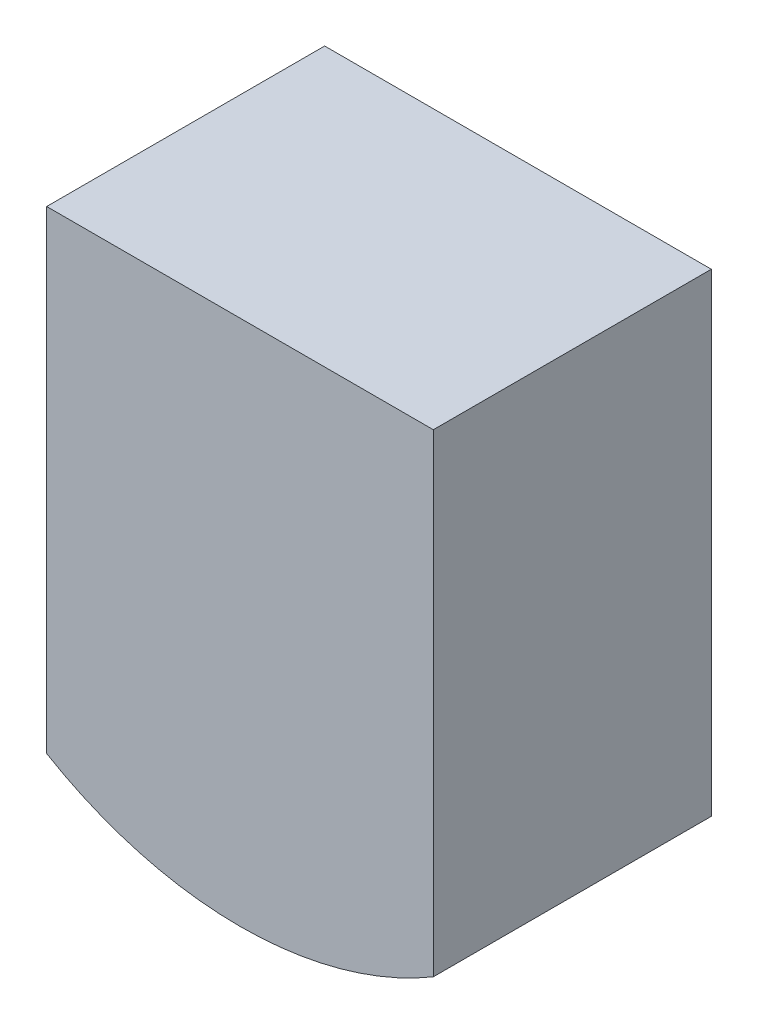
ISO-10303-21;
HEADER;
FILE_DESCRIPTION(('STEP AP214'),'2;1');
FILE_NAME('part.step','',(''),(''),'','','');
FILE_SCHEMA(('AUTOMOTIVE_DESIGN { 1 0 10303 214 1 1 1 1 }'));
ENDSEC;
DATA;
#1=APPLICATION_CONTEXT('core data for automotive mechanical design processes');
#2=APPLICATION_PROTOCOL_DEFINITION('international standard','automotive_design',2000,#1);
#3=PRODUCT_CONTEXT('',#1,'mechanical');
#4=PRODUCT('Part','Part','',(#3));
#5=PRODUCT_RELATED_PRODUCT_CATEGORY('part','',(#4));
#6=PRODUCT_DEFINITION_FORMATION('','',#4);
#7=PRODUCT_DEFINITION_CONTEXT('part definition',#1,'design');
#8=PRODUCT_DEFINITION('design','',#6,#7);
#9=PRODUCT_DEFINITION_SHAPE('','',#8);
#10=(LENGTH_UNIT() NAMED_UNIT(*) SI_UNIT(.MILLI.,.METRE.));
#11=(NAMED_UNIT(*) PLANE_ANGLE_UNIT() SI_UNIT($,.RADIAN.));
#12=(NAMED_UNIT(*) SI_UNIT($,.STERADIAN.) SOLID_ANGLE_UNIT());
#13=UNCERTAINTY_MEASURE_WITH_UNIT(LENGTH_MEASURE(1.E-05),#10,'distance_accuracy_value','');
#14=(GEOMETRIC_REPRESENTATION_CONTEXT(3) GLOBAL_UNCERTAINTY_ASSIGNED_CONTEXT((#13)) GLOBAL_UNIT_ASSIGNED_CONTEXT((#10,
#11,#12)) REPRESENTATION_CONTEXT('',''));
#15=CARTESIAN_POINT('',(0.,0.,0.));
#16=DIRECTION('',(0.,0.,1.));
#17=DIRECTION('',(1.,0.,0.));
#18=AXIS2_PLACEMENT_3D('',#15,#16,#17);
#19=CARTESIAN_POINT('',(5.37000000000007,-8.33473839861833,3.3));
#20=DIRECTION('',(0.,0.,1.));
#21=DIRECTION('',(0.,-1.,0.));
#22=AXIS2_PLACEMENT_3D('',#19,#20,#21);
#23=PLANE('',#22);
#24=DIRECTION('',(0.,-1.,0.));
#25=VECTOR('',#24,1.);
#26=CARTESIAN_POINT('',(3.84000000000006,-10.,3.3));
#27=LINE('',#26,#25);
#28=CARTESIAN_POINT('',(3.84000000000008,-6.25,3.3));
#29=VERTEX_POINT('',#28);
#30=CARTESIAN_POINT('',(3.84000000000006,-10.,3.3));
#31=VERTEX_POINT('',#30);
#32=EDGE_CURVE('E11',#29,#31,#27,.T.);
#33=ORIENTED_EDGE('',*,*,#32,.T.);
#34=CARTESIAN_POINT('',(5.37000000000006,-7.41947679723665,3.3));
#35=DIRECTION('',(0.,0.,1.));
#36=DIRECTION('',(-0.51,-0.860174400921116,0.));
#37=AXIS2_PLACEMENT_3D('',#34,#35,#36);
#38=CIRCLE('',#37,3.);
#39=CARTESIAN_POINT('',(6.9,-10.,3.3));
#40=VERTEX_POINT('',#39);
#41=EDGE_CURVE('E44',#31,#40,#38,.T.);
#42=ORIENTED_EDGE('',*,*,#41,.T.);
#43=DIRECTION('',(0.,1.,0.));
#44=VECTOR('',#43,1.);
#45=CARTESIAN_POINT('',(6.9,-6.25,3.3));
#46=LINE('',#45,#44);
#47=CARTESIAN_POINT('',(6.9,-6.25,3.3));
#48=VERTEX_POINT('',#47);
#49=EDGE_CURVE('E101',#40,#48,#46,.T.);
#50=ORIENTED_EDGE('',*,*,#49,.T.);
#51=DIRECTION('',(-1.,0.,0.));
#52=VECTOR('',#51,1.);
#53=CARTESIAN_POINT('',(3.84000000000008,-6.25,3.3));
#54=LINE('',#53,#52);
#55=EDGE_CURVE('E102',#48,#29,#54,.T.);
#56=ORIENTED_EDGE('',*,*,#55,.T.);
#57=EDGE_LOOP('',(#33,#42,#50,#56));
#58=FACE_BOUND('',#57,.T.);
#59=ADVANCED_FACE('F16',(#58),#23,.T.);
#60=CARTESIAN_POINT('',(3.84000000000008,-6.25,2.2));
#61=DIRECTION('',(-1.,0.,0.));
#62=DIRECTION('',(0.,0.,1.));
#63=AXIS2_PLACEMENT_3D('',#60,#61,#62);
#64=PLANE('',#63);
#65=DIRECTION('',(0.,0.,1.));
#66=VECTOR('',#65,1.);
#67=CARTESIAN_POINT('',(3.84000000000006,-10.,2.2));
#68=LINE('',#67,#66);
#69=CARTESIAN_POINT('',(3.84000000000007,-10.,1.1));
#70=VERTEX_POINT('',#69);
#71=EDGE_CURVE('E26',#70,#31,#68,.T.);
#72=ORIENTED_EDGE('',*,*,#71,.T.);
#73=ORIENTED_EDGE('',*,*,#32,.F.);
#74=DIRECTION('',(0.,0.,-1.));
#75=VECTOR('',#74,1.);
#76=CARTESIAN_POINT('',(3.84000000000008,-6.25,2.2));
#77=LINE('',#76,#75);
#78=CARTESIAN_POINT('',(3.84000000000008,-6.25,1.1));
#79=VERTEX_POINT('',#78);
#80=EDGE_CURVE('E20',#29,#79,#77,.T.);
#81=ORIENTED_EDGE('',*,*,#80,.T.);
#82=DIRECTION('',(0.,1.,0.));
#83=VECTOR('',#82,1.);
#84=CARTESIAN_POINT('',(3.84000000000007,-10.,1.1));
#85=LINE('',#84,#83);
#86=EDGE_CURVE('E81',#70,#79,#85,.T.);
#87=ORIENTED_EDGE('',*,*,#86,.F.);
#88=EDGE_LOOP('',(#72,#73,#81,#87));
#89=FACE_BOUND('',#88,.T.);
#90=ADVANCED_FACE('F86',(#89),#64,.T.);
#91=CARTESIAN_POINT('',(5.37000000000006,-7.41947679723665,2.2));
#92=DIRECTION('',(0.,0.,1.));
#93=DIRECTION('',(-0.51,-0.860174400921116,0.));
#94=AXIS2_PLACEMENT_3D('',#91,#92,#93);
#95=CYLINDRICAL_SURFACE('',#94,3.);
#96=DIRECTION('',(0.,0.,1.));
#97=VECTOR('',#96,1.);
#98=CARTESIAN_POINT('',(6.9,-10.,2.2));
#99=LINE('',#98,#97);
#100=CARTESIAN_POINT('',(6.9,-10.,1.1));
#101=VERTEX_POINT('',#100);
#102=EDGE_CURVE('E110',#101,#40,#99,.T.);
#103=ORIENTED_EDGE('',*,*,#102,.T.);
#104=ORIENTED_EDGE('',*,*,#41,.F.);
#105=ORIENTED_EDGE('',*,*,#71,.F.);
#106=CARTESIAN_POINT('',(5.37000000000007,-7.41947679723665,1.1));
#107=DIRECTION('',(0.,0.,-1.));
#108=DIRECTION('',(-0.51,-0.860174400921116,0.));
#109=AXIS2_PLACEMENT_3D('',#106,#107,#108);
#110=CIRCLE('',#109,3.);
#111=EDGE_CURVE('E71',#101,#70,#110,.T.);
#112=ORIENTED_EDGE('',*,*,#111,.F.);
#113=EDGE_LOOP('',(#103,#104,#105,#112));
#114=FACE_BOUND('',#113,.T.);
#115=ADVANCED_FACE('F18',(#114),#95,.T.);
#116=CARTESIAN_POINT('',(6.9,-10.,2.2));
#117=DIRECTION('',(1.,0.,0.));
#118=DIRECTION('',(0.,-1.,0.));
#119=AXIS2_PLACEMENT_3D('',#116,#117,#118);
#120=PLANE('',#119);
#121=DIRECTION('',(0.,0.,1.));
#122=VECTOR('',#121,1.);
#123=CARTESIAN_POINT('',(6.9,-6.25,2.2));
#124=LINE('',#123,#122);
#125=CARTESIAN_POINT('',(6.9,-6.25,1.1));
#126=VERTEX_POINT('',#125);
#127=EDGE_CURVE('E98',#126,#48,#124,.T.);
#128=ORIENTED_EDGE('',*,*,#127,.T.);
#129=ORIENTED_EDGE('',*,*,#49,.F.);
#130=ORIENTED_EDGE('',*,*,#102,.F.);
#131=DIRECTION('',(0.,-1.,0.));
#132=VECTOR('',#131,1.);
#133=CARTESIAN_POINT('',(6.9,-6.25,1.1));
#134=LINE('',#133,#132);
#135=EDGE_CURVE('E83',#126,#101,#134,.T.);
#136=ORIENTED_EDGE('',*,*,#135,.F.);
#137=EDGE_LOOP('',(#128,#129,#130,#136));
#138=FACE_BOUND('',#137,.T.);
#139=ADVANCED_FACE('F160',(#138),#120,.T.);
#140=CARTESIAN_POINT('',(6.9,-6.25,2.2));
#141=DIRECTION('',(0.,1.,0.));
#142=DIRECTION('',(1.,0.,0.));
#143=AXIS2_PLACEMENT_3D('',#140,#141,#142);
#144=PLANE('',#143);
#145=ORIENTED_EDGE('',*,*,#80,.F.);
#146=ORIENTED_EDGE('',*,*,#55,.F.);
#147=ORIENTED_EDGE('',*,*,#127,.F.);
#148=DIRECTION('',(1.,0.,0.));
#149=VECTOR('',#148,1.);
#150=CARTESIAN_POINT('',(3.84000000000008,-6.25,1.1));
#151=LINE('',#150,#149);
#152=EDGE_CURVE('E90',#79,#126,#151,.T.);
#153=ORIENTED_EDGE('',*,*,#152,.F.);
#154=EDGE_LOOP('',(#145,#146,#147,#153));
#155=FACE_BOUND('',#154,.T.);
#156=ADVANCED_FACE('F154',(#155),#144,.T.);
#157=CARTESIAN_POINT('',(5.37000000000007,-8.33473839861833,1.1));
#158=DIRECTION('',(0.,0.,1.));
#159=DIRECTION('',(0.,-1.,0.));
#160=AXIS2_PLACEMENT_3D('',#157,#158,#159);
#161=PLANE('',#160);
#162=ORIENTED_EDGE('',*,*,#86,.T.);
#163=ORIENTED_EDGE('',*,*,#152,.T.);
#164=ORIENTED_EDGE('',*,*,#135,.T.);
#165=ORIENTED_EDGE('',*,*,#111,.T.);
#166=EDGE_LOOP('',(#162,#163,#164,#165));
#167=FACE_BOUND('',#166,.T.);
#168=ADVANCED_FACE('F79',(#167),#161,.F.);
#169=CLOSED_SHELL('',(#59,#90,#115,#139,#156,#168));
#170=MANIFOLD_SOLID_BREP('B1',#169);
#171=ADVANCED_BREP_SHAPE_REPRESENTATION('',(#18,#170),#14);
#172=SHAPE_DEFINITION_REPRESENTATION(#9,#171);
ENDSEC;
END-ISO-10303-21;
